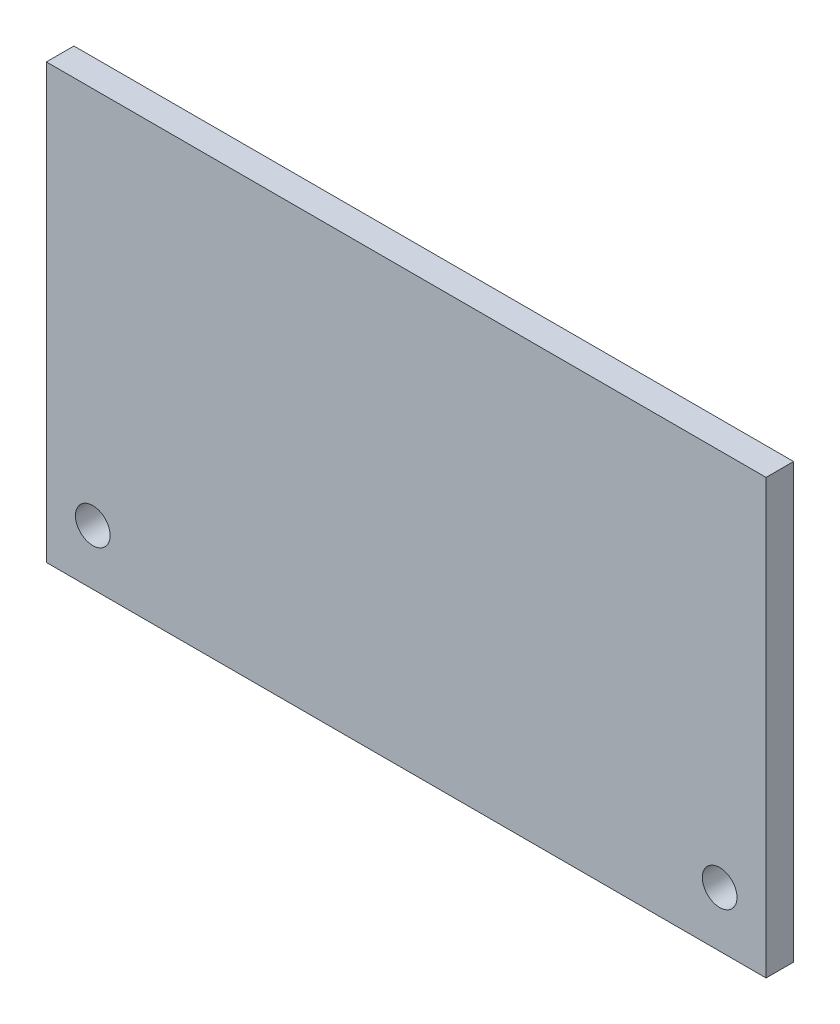
ISO-10303-21;
HEADER;
FILE_DESCRIPTION(('STEP AP214'),'2;1');
FILE_NAME('part.step','',(''),(''),'','','');
FILE_SCHEMA(('AUTOMOTIVE_DESIGN { 1 0 10303 214 1 1 1 1 }'));
ENDSEC;
DATA;
#1=APPLICATION_CONTEXT('core data for automotive mechanical design processes');
#2=APPLICATION_PROTOCOL_DEFINITION('international standard','automotive_design',2000,#1);
#3=PRODUCT_CONTEXT('',#1,'mechanical');
#4=PRODUCT('Part','Part','',(#3));
#5=PRODUCT_RELATED_PRODUCT_CATEGORY('part','',(#4));
#6=PRODUCT_DEFINITION_FORMATION('','',#4);
#7=PRODUCT_DEFINITION_CONTEXT('part definition',#1,'design');
#8=PRODUCT_DEFINITION('design','',#6,#7);
#9=PRODUCT_DEFINITION_SHAPE('','',#8);
#10=(LENGTH_UNIT() NAMED_UNIT(*) SI_UNIT(.MILLI.,.METRE.));
#11=(NAMED_UNIT(*) PLANE_ANGLE_UNIT() SI_UNIT($,.RADIAN.));
#12=(NAMED_UNIT(*) SI_UNIT($,.STERADIAN.) SOLID_ANGLE_UNIT());
#13=UNCERTAINTY_MEASURE_WITH_UNIT(LENGTH_MEASURE(1.E-05),#10,'distance_accuracy_value','');
#14=(GEOMETRIC_REPRESENTATION_CONTEXT(3) GLOBAL_UNCERTAINTY_ASSIGNED_CONTEXT((#13)) GLOBAL_UNIT_ASSIGNED_CONTEXT((#10,
#11,#12)) REPRESENTATION_CONTEXT('',''));
#15=CARTESIAN_POINT('',(0.,0.,0.));
#16=DIRECTION('',(0.,0.,1.));
#17=DIRECTION('',(1.,0.,0.));
#18=AXIS2_PLACEMENT_3D('',#15,#16,#17);
#19=CARTESIAN_POINT('',(83.,50.,6.35));
#20=DIRECTION('',(-1.,0.,0.));
#21=DIRECTION('',(0.,0.,1.));
#22=AXIS2_PLACEMENT_3D('',#19,#20,#21);
#23=PLANE('',#22);
#24=DIRECTION('',(0.,1.,0.));
#25=VECTOR('',#24,1.);
#26=CARTESIAN_POINT('',(83.,50.,0.));
#27=LINE('',#26,#25);
#28=CARTESIAN_POINT('',(83.,-50.,0.));
#29=VERTEX_POINT('',#28);
#30=CARTESIAN_POINT('',(83.,50.,0.));
#31=VERTEX_POINT('',#30);
#32=EDGE_CURVE('E110',#29,#31,#27,.T.);
#33=ORIENTED_EDGE('',*,*,#32,.T.);
#34=DIRECTION('',(0.,0.,-1.));
#35=VECTOR('',#34,1.);
#36=CARTESIAN_POINT('',(83.,50.,6.35));
#37=LINE('',#36,#35);
#38=CARTESIAN_POINT('',(83.,50.,6.35));
#39=VERTEX_POINT('',#38);
#40=EDGE_CURVE('E11',#39,#31,#37,.T.);
#41=ORIENTED_EDGE('',*,*,#40,.F.);
#42=DIRECTION('',(0.,1.,0.));
#43=VECTOR('',#42,1.);
#44=CARTESIAN_POINT('',(83.,50.,6.35));
#45=LINE('',#44,#43);
#46=CARTESIAN_POINT('',(83.,-50.,6.35));
#47=VERTEX_POINT('',#46);
#48=EDGE_CURVE('E93',#47,#39,#45,.T.);
#49=ORIENTED_EDGE('',*,*,#48,.F.);
#50=DIRECTION('',(0.,0.,-1.));
#51=VECTOR('',#50,1.);
#52=CARTESIAN_POINT('',(83.,-50.,6.35));
#53=LINE('',#52,#51);
#54=EDGE_CURVE('E106',#47,#29,#53,.T.);
#55=ORIENTED_EDGE('',*,*,#54,.T.);
#56=EDGE_LOOP('',(#33,#41,#49,#55));
#57=FACE_BOUND('',#56,.T.);
#58=ADVANCED_FACE('F39',(#57),#23,.F.);
#59=CARTESIAN_POINT('',(-83.,50.,6.35));
#60=DIRECTION('',(0.,-1.,0.));
#61=DIRECTION('',(0.,0.,-1.));
#62=AXIS2_PLACEMENT_3D('',#59,#60,#61);
#63=PLANE('',#62);
#64=DIRECTION('',(-1.,0.,0.));
#65=VECTOR('',#64,1.);
#66=CARTESIAN_POINT('',(-83.,50.,0.));
#67=LINE('',#66,#65);
#68=CARTESIAN_POINT('',(-83.,50.,0.));
#69=VERTEX_POINT('',#68);
#70=EDGE_CURVE('E98',#31,#69,#67,.T.);
#71=ORIENTED_EDGE('',*,*,#70,.T.);
#72=DIRECTION('',(0.,0.,-1.));
#73=VECTOR('',#72,1.);
#74=CARTESIAN_POINT('',(-83.,50.,6.35));
#75=LINE('',#74,#73);
#76=CARTESIAN_POINT('',(-83.,50.,6.35));
#77=VERTEX_POINT('',#76);
#78=EDGE_CURVE('E47',#77,#69,#75,.T.);
#79=ORIENTED_EDGE('',*,*,#78,.F.);
#80=DIRECTION('',(-1.,0.,0.));
#81=VECTOR('',#80,1.);
#82=CARTESIAN_POINT('',(-83.,50.,6.35));
#83=LINE('',#82,#81);
#84=EDGE_CURVE('E88',#39,#77,#83,.T.);
#85=ORIENTED_EDGE('',*,*,#84,.F.);
#86=ORIENTED_EDGE('',*,*,#40,.T.);
#87=EDGE_LOOP('',(#71,#79,#85,#86));
#88=FACE_BOUND('',#87,.T.);
#89=ADVANCED_FACE('F97',(#88),#63,.F.);
#90=CARTESIAN_POINT('',(-83.,50.,6.35));
#91=DIRECTION('',(1.,0.,0.));
#92=DIRECTION('',(0.,0.,-1.));
#93=AXIS2_PLACEMENT_3D('',#90,#91,#92);
#94=PLANE('',#93);
#95=DIRECTION('',(0.,-1.,0.));
#96=VECTOR('',#95,1.);
#97=CARTESIAN_POINT('',(-83.,50.,0.));
#98=LINE('',#97,#96);
#99=CARTESIAN_POINT('',(-83.,-50.,0.));
#100=VERTEX_POINT('',#99);
#101=EDGE_CURVE('E75',#69,#100,#98,.T.);
#102=ORIENTED_EDGE('',*,*,#101,.T.);
#103=DIRECTION('',(0.,0.,-1.));
#104=VECTOR('',#103,1.);
#105=CARTESIAN_POINT('',(-83.,-50.,6.35));
#106=LINE('',#105,#104);
#107=CARTESIAN_POINT('',(-83.,-50.,6.35));
#108=VERTEX_POINT('',#107);
#109=EDGE_CURVE('E99',#108,#100,#106,.T.);
#110=ORIENTED_EDGE('',*,*,#109,.F.);
#111=DIRECTION('',(0.,-1.,0.));
#112=VECTOR('',#111,1.);
#113=CARTESIAN_POINT('',(-83.,50.,6.35));
#114=LINE('',#113,#112);
#115=EDGE_CURVE('E91',#77,#108,#114,.T.);
#116=ORIENTED_EDGE('',*,*,#115,.F.);
#117=ORIENTED_EDGE('',*,*,#78,.T.);
#118=EDGE_LOOP('',(#102,#110,#116,#117));
#119=FACE_BOUND('',#118,.T.);
#120=ADVANCED_FACE('F100',(#119),#94,.F.);
#121=CARTESIAN_POINT('',(-83.,-50.,6.35));
#122=DIRECTION('',(0.,1.,0.));
#123=DIRECTION('',(0.,0.,1.));
#124=AXIS2_PLACEMENT_3D('',#121,#122,#123);
#125=PLANE('',#124);
#126=DIRECTION('',(1.,0.,0.));
#127=VECTOR('',#126,1.);
#128=CARTESIAN_POINT('',(-83.,-50.,0.));
#129=LINE('',#128,#127);
#130=EDGE_CURVE('E81',#100,#29,#129,.T.);
#131=ORIENTED_EDGE('',*,*,#130,.T.);
#132=ORIENTED_EDGE('',*,*,#54,.F.);
#133=DIRECTION('',(1.,0.,0.));
#134=VECTOR('',#133,1.);
#135=CARTESIAN_POINT('',(-83.,-50.,6.35));
#136=LINE('',#135,#134);
#137=EDGE_CURVE('E57',#108,#47,#136,.T.);
#138=ORIENTED_EDGE('',*,*,#137,.F.);
#139=ORIENTED_EDGE('',*,*,#109,.T.);
#140=EDGE_LOOP('',(#131,#132,#138,#139));
#141=FACE_BOUND('',#140,.T.);
#142=ADVANCED_FACE('F124',(#141),#125,.F.);
#143=CARTESIAN_POINT('',(0.,0.,6.35));
#144=DIRECTION('',(0.,0.,1.));
#145=DIRECTION('',(1.,0.,0.));
#146=AXIS2_PLACEMENT_3D('',#143,#144,#145);
#147=PLANE('',#146);
#148=CARTESIAN_POINT('',(72.3,-37.27,6.35));
#149=DIRECTION('',(0.,0.,1.));
#150=DIRECTION('',(1.,0.,0.));
#151=AXIS2_PLACEMENT_3D('',#148,#149,#150);
#152=CIRCLE('',#151,4.00000000000001);
#153=CARTESIAN_POINT('',(76.3,-37.27,6.35));
#154=VERTEX_POINT('',#153);
#155=EDGE_CURVE('E137',#154,#154,#152,.T.);
#156=ORIENTED_EDGE('',*,*,#155,.F.);
#157=EDGE_LOOP('',(#156));
#158=FACE_BOUND('',#157,.T.);
#159=CARTESIAN_POINT('',(-72.3,-37.27,6.35));
#160=DIRECTION('',(0.,0.,1.));
#161=DIRECTION('',(1.,0.,0.));
#162=AXIS2_PLACEMENT_3D('',#159,#160,#161);
#163=CIRCLE('',#162,4.00000000000001);
#164=CARTESIAN_POINT('',(-68.3,-37.27,6.35));
#165=VERTEX_POINT('',#164);
#166=EDGE_CURVE('E131',#165,#165,#163,.T.);
#167=ORIENTED_EDGE('',*,*,#166,.F.);
#168=EDGE_LOOP('',(#167));
#169=FACE_BOUND('',#168,.T.);
#170=ORIENTED_EDGE('',*,*,#48,.T.);
#171=ORIENTED_EDGE('',*,*,#84,.T.);
#172=ORIENTED_EDGE('',*,*,#115,.T.);
#173=ORIENTED_EDGE('',*,*,#137,.T.);
#174=EDGE_LOOP('',(#170,#171,#172,#173));
#175=FACE_BOUND('',#174,.T.);
#176=ADVANCED_FACE('F89',(#158,#169,#175),#147,.T.);
#177=CARTESIAN_POINT('',(0.,0.,0.));
#178=DIRECTION('',(0.,0.,1.));
#179=DIRECTION('',(1.,0.,0.));
#180=AXIS2_PLACEMENT_3D('',#177,#178,#179);
#181=PLANE('',#180);
#182=CARTESIAN_POINT('',(72.3,-37.27,0.));
#183=DIRECTION('',(0.,0.,1.));
#184=DIRECTION('',(1.,0.,0.));
#185=AXIS2_PLACEMENT_3D('',#182,#183,#184);
#186=CIRCLE('',#185,4.00000000000001);
#187=CARTESIAN_POINT('',(76.3,-37.27,0.));
#188=VERTEX_POINT('',#187);
#189=EDGE_CURVE('E134',#188,#188,#186,.T.);
#190=ORIENTED_EDGE('',*,*,#189,.T.);
#191=EDGE_LOOP('',(#190));
#192=FACE_BOUND('',#191,.T.);
#193=CARTESIAN_POINT('',(-72.3,-37.27,0.));
#194=DIRECTION('',(0.,0.,1.));
#195=DIRECTION('',(1.,0.,0.));
#196=AXIS2_PLACEMENT_3D('',#193,#194,#195);
#197=CIRCLE('',#196,4.00000000000001);
#198=CARTESIAN_POINT('',(-68.3,-37.27,0.));
#199=VERTEX_POINT('',#198);
#200=EDGE_CURVE('E114',#199,#199,#197,.T.);
#201=ORIENTED_EDGE('',*,*,#200,.T.);
#202=EDGE_LOOP('',(#201));
#203=FACE_BOUND('',#202,.T.);
#204=ORIENTED_EDGE('',*,*,#32,.F.);
#205=ORIENTED_EDGE('',*,*,#130,.F.);
#206=ORIENTED_EDGE('',*,*,#101,.F.);
#207=ORIENTED_EDGE('',*,*,#70,.F.);
#208=EDGE_LOOP('',(#204,#205,#206,#207));
#209=FACE_BOUND('',#208,.T.);
#210=ADVANCED_FACE('F127',(#192,#203,#209),#181,.F.);
#211=CARTESIAN_POINT('',(-72.3,-37.27,0.));
#212=DIRECTION('',(0.,0.,1.));
#213=DIRECTION('',(1.,0.,0.));
#214=AXIS2_PLACEMENT_3D('',#211,#212,#213);
#215=CYLINDRICAL_SURFACE('',#214,4.00000000000001);
#216=ORIENTED_EDGE('',*,*,#200,.F.);
#217=EDGE_LOOP('',(#216));
#218=FACE_BOUND('',#217,.T.);
#219=ORIENTED_EDGE('',*,*,#166,.T.);
#220=EDGE_LOOP('',(#219));
#221=FACE_BOUND('',#220,.T.);
#222=ADVANCED_FACE('F150',(#218,#221),#215,.F.);
#223=CARTESIAN_POINT('',(72.3,-37.27,0.));
#224=DIRECTION('',(0.,0.,1.));
#225=DIRECTION('',(1.,0.,0.));
#226=AXIS2_PLACEMENT_3D('',#223,#224,#225);
#227=CYLINDRICAL_SURFACE('',#226,4.00000000000001);
#228=ORIENTED_EDGE('',*,*,#189,.F.);
#229=EDGE_LOOP('',(#228));
#230=FACE_BOUND('',#229,.T.);
#231=ORIENTED_EDGE('',*,*,#155,.T.);
#232=EDGE_LOOP('',(#231));
#233=FACE_BOUND('',#232,.T.);
#234=ADVANCED_FACE('F147',(#230,#233),#227,.F.);
#235=CLOSED_SHELL('',(#58,#89,#120,#142,#176,#210,#222,#234));
#236=MANIFOLD_SOLID_BREP('B2',#235);
#237=ADVANCED_BREP_SHAPE_REPRESENTATION('',(#18,#236),#14);
#238=SHAPE_DEFINITION_REPRESENTATION(#9,#237);
ENDSEC;
END-ISO-10303-21;
